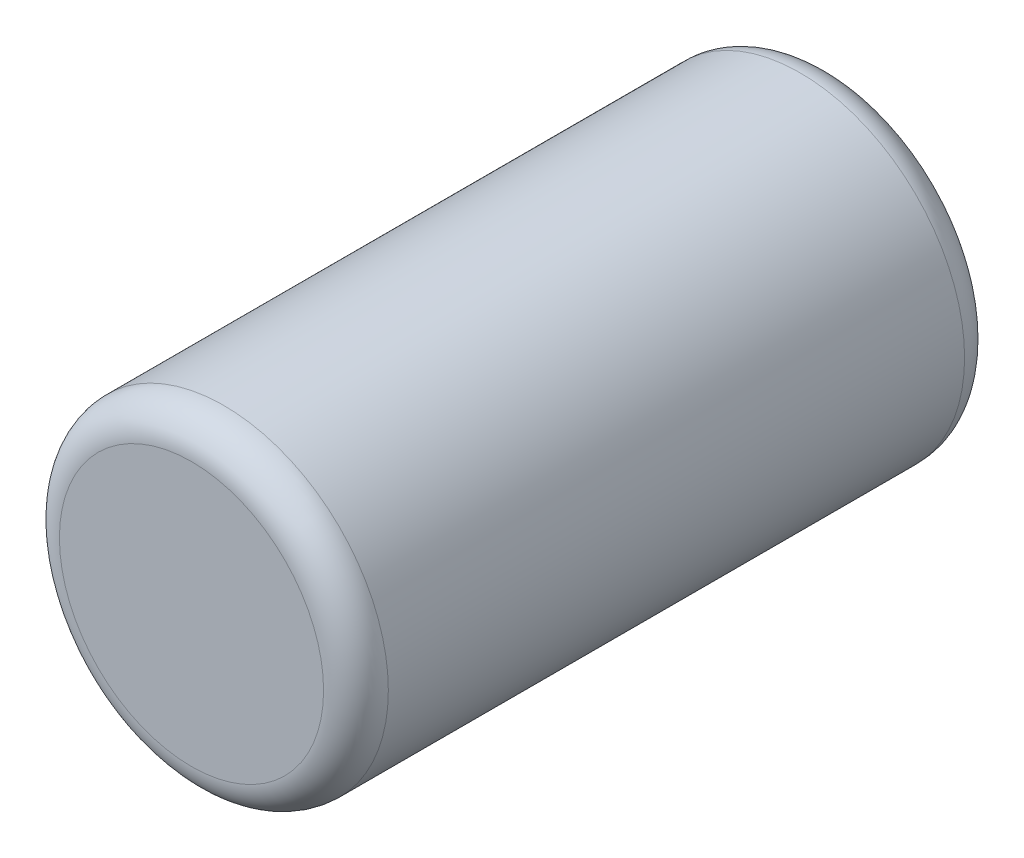
ISO-10303-21;
HEADER;
FILE_DESCRIPTION(('STEP AP214'),'2;1');
FILE_NAME('part.step','',(''),(''),'','','');
FILE_SCHEMA(('AUTOMOTIVE_DESIGN { 1 0 10303 214 1 1 1 1 }'));
ENDSEC;
DATA;
#1=APPLICATION_CONTEXT('core data for automotive mechanical design processes');
#2=APPLICATION_PROTOCOL_DEFINITION('international standard','automotive_design',2000,#1);
#3=PRODUCT_CONTEXT('',#1,'mechanical');
#4=PRODUCT('Part','Part','',(#3));
#5=PRODUCT_RELATED_PRODUCT_CATEGORY('part','',(#4));
#6=PRODUCT_DEFINITION_FORMATION('','',#4);
#7=PRODUCT_DEFINITION_CONTEXT('part definition',#1,'design');
#8=PRODUCT_DEFINITION('design','',#6,#7);
#9=PRODUCT_DEFINITION_SHAPE('','',#8);
#10=(LENGTH_UNIT() NAMED_UNIT(*) SI_UNIT(.MILLI.,.METRE.));
#11=(NAMED_UNIT(*) PLANE_ANGLE_UNIT() SI_UNIT($,.RADIAN.));
#12=(NAMED_UNIT(*) SI_UNIT($,.STERADIAN.) SOLID_ANGLE_UNIT());
#13=UNCERTAINTY_MEASURE_WITH_UNIT(LENGTH_MEASURE(1.E-05),#10,'distance_accuracy_value','');
#14=(GEOMETRIC_REPRESENTATION_CONTEXT(3) GLOBAL_UNCERTAINTY_ASSIGNED_CONTEXT((#13)) GLOBAL_UNIT_ASSIGNED_CONTEXT((#10,
#11,#12)) REPRESENTATION_CONTEXT('',''));
#15=CARTESIAN_POINT('',(0.,0.,0.));
#16=DIRECTION('',(0.,0.,1.));
#17=DIRECTION('',(1.,0.,0.));
#18=AXIS2_PLACEMENT_3D('',#15,#16,#17);
#19=CARTESIAN_POINT('',(0.,0.,99.));
#20=DIRECTION('',(0.,0.,-1.));
#21=DIRECTION('',(-1.,0.,0.));
#22=AXIS2_PLACEMENT_3D('',#19,#20,#21);
#23=CYLINDRICAL_SURFACE('',#22,25.4);
#24=CARTESIAN_POINT('',(0.,0.,94.));
#25=DIRECTION('',(0.,0.,1.));
#26=DIRECTION('',(1.,0.,0.));
#27=AXIS2_PLACEMENT_3D('',#24,#25,#26);
#28=CIRCLE('',#27,25.4);
#29=CARTESIAN_POINT('',(25.4,0.,94.));
#30=VERTEX_POINT('',#29);
#31=EDGE_CURVE('E47',#30,#30,#28,.F.);
#32=ORIENTED_EDGE('',*,*,#31,.T.);
#33=EDGE_LOOP('',(#32));
#34=FACE_BOUND('',#33,.T.);
#35=CARTESIAN_POINT('',(0.,0.,4.99999999999999));
#36=DIRECTION('',(0.,0.,1.));
#37=DIRECTION('',(1.,0.,0.));
#38=AXIS2_PLACEMENT_3D('',#35,#36,#37);
#39=CIRCLE('',#38,25.4);
#40=CARTESIAN_POINT('',(25.4,0.,4.99999999999999));
#41=VERTEX_POINT('',#40);
#42=EDGE_CURVE('E52',#41,#41,#39,.T.);
#43=ORIENTED_EDGE('',*,*,#42,.T.);
#44=EDGE_LOOP('',(#43));
#45=FACE_BOUND('',#44,.T.);
#46=ADVANCED_FACE('F39',(#34,#45),#23,.T.);
#47=CARTESIAN_POINT('',(0.,0.,99.));
#48=DIRECTION('',(0.,0.,1.));
#49=DIRECTION('',(1.,0.,0.));
#50=AXIS2_PLACEMENT_3D('',#47,#48,#49);
#51=PLANE('',#50);
#52=CARTESIAN_POINT('',(0.,0.,99.));
#53=DIRECTION('',(0.,0.,1.));
#54=DIRECTION('',(1.,0.,0.));
#55=AXIS2_PLACEMENT_3D('',#52,#53,#54);
#56=CIRCLE('',#55,20.4);
#57=CARTESIAN_POINT('',(20.4,0.,99.));
#58=VERTEX_POINT('',#57);
#59=EDGE_CURVE('E57',#58,#58,#56,.T.);
#60=ORIENTED_EDGE('',*,*,#59,.T.);
#61=EDGE_LOOP('',(#60));
#62=FACE_BOUND('',#61,.T.);
#63=ADVANCED_FACE('F64',(#62),#51,.T.);
#64=CARTESIAN_POINT('',(0.,0.,0.));
#65=DIRECTION('',(0.,0.,1.));
#66=DIRECTION('',(1.,0.,0.));
#67=AXIS2_PLACEMENT_3D('',#64,#65,#66);
#68=PLANE('',#67);
#69=CARTESIAN_POINT('',(0.,0.,0.));
#70=DIRECTION('',(0.,0.,1.));
#71=DIRECTION('',(1.,0.,0.));
#72=AXIS2_PLACEMENT_3D('',#69,#70,#71);
#73=CIRCLE('',#72,20.4);
#74=CARTESIAN_POINT('',(20.4,0.,0.));
#75=VERTEX_POINT('',#74);
#76=EDGE_CURVE('E10',#75,#75,#73,.F.);
#77=ORIENTED_EDGE('',*,*,#76,.T.);
#78=EDGE_LOOP('',(#77));
#79=FACE_BOUND('',#78,.T.);
#80=ADVANCED_FACE('F68',(#79),#68,.F.);
#81=CARTESIAN_POINT('',(0.,0.,94.));
#82=DIRECTION('',(0.,0.,1.));
#83=DIRECTION('',(1.,0.,0.));
#84=AXIS2_PLACEMENT_3D('',#81,#82,#83);
#85=TOROIDAL_SURFACE('',#84,20.4,5.);
#86=ORIENTED_EDGE('',*,*,#31,.F.);
#87=EDGE_LOOP('',(#86));
#88=FACE_BOUND('',#87,.T.);
#89=ORIENTED_EDGE('',*,*,#59,.F.);
#90=EDGE_LOOP('',(#89));
#91=FACE_BOUND('',#90,.T.);
#92=ADVANCED_FACE('F66',(#88,#91),#85,.T.);
#93=CARTESIAN_POINT('',(0.,0.,5.));
#94=DIRECTION('',(0.,0.,1.));
#95=DIRECTION('',(1.,0.,0.));
#96=AXIS2_PLACEMENT_3D('',#93,#94,#95);
#97=TOROIDAL_SURFACE('',#96,20.4,5.);
#98=ORIENTED_EDGE('',*,*,#76,.F.);
#99=EDGE_LOOP('',(#98));
#100=FACE_BOUND('',#99,.T.);
#101=ORIENTED_EDGE('',*,*,#42,.F.);
#102=EDGE_LOOP('',(#101));
#103=FACE_BOUND('',#102,.T.);
#104=ADVANCED_FACE('F41',(#100,#103),#97,.T.);
#105=CLOSED_SHELL('',(#46,#63,#80,#92,#104));
#106=MANIFOLD_SOLID_BREP('B2',#105);
#107=ADVANCED_BREP_SHAPE_REPRESENTATION('',(#18,#106),#14);
#108=SHAPE_DEFINITION_REPRESENTATION(#9,#107);
ENDSEC;
END-ISO-10303-21;
